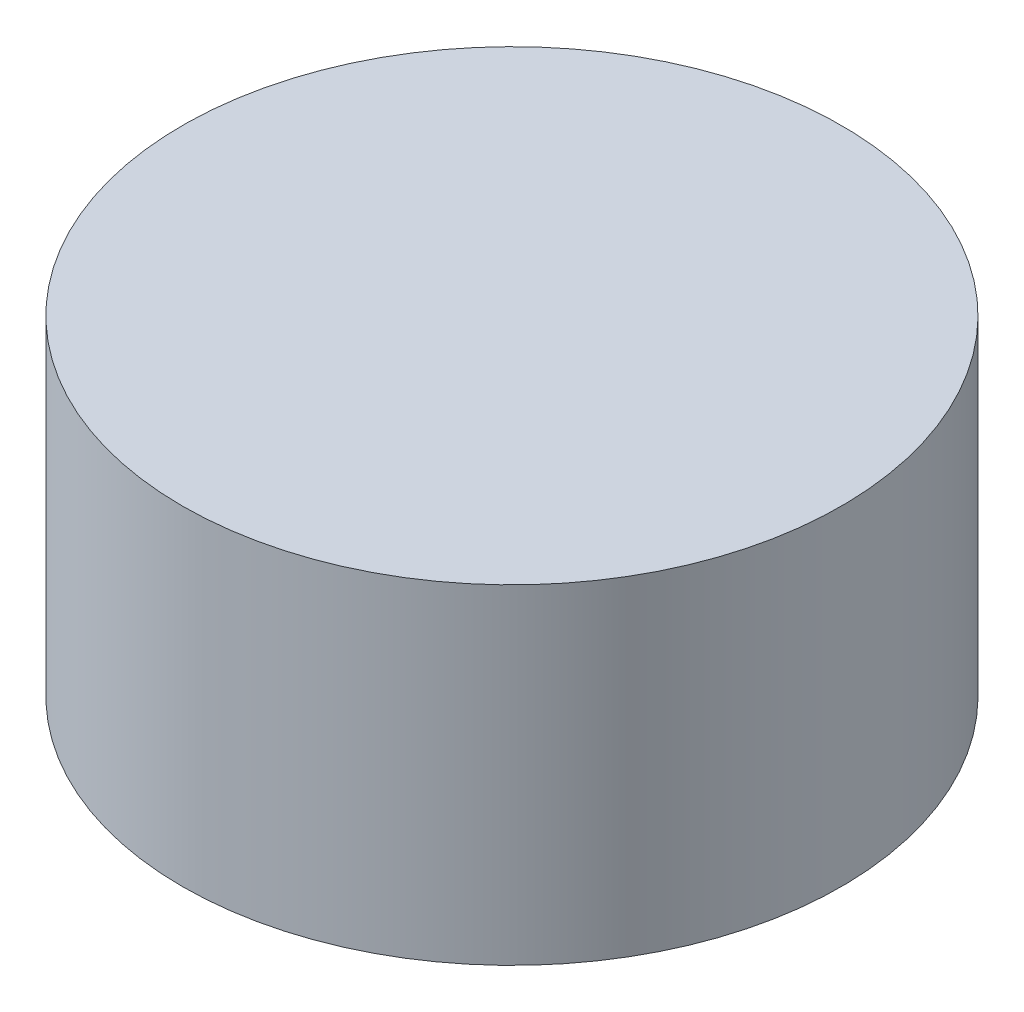
ISO-10303-21;
HEADER;
FILE_DESCRIPTION(('STEP AP214'),'2;1');
FILE_NAME('part.step','',(''),(''),'','','');
FILE_SCHEMA(('AUTOMOTIVE_DESIGN { 1 0 10303 214 1 1 1 1 }'));
ENDSEC;
DATA;
#1=APPLICATION_CONTEXT('core data for automotive mechanical design processes');
#2=APPLICATION_PROTOCOL_DEFINITION('international standard','automotive_design',2000,#1);
#3=PRODUCT_CONTEXT('',#1,'mechanical');
#4=PRODUCT('Part','Part','',(#3));
#5=PRODUCT_RELATED_PRODUCT_CATEGORY('part','',(#4));
#6=PRODUCT_DEFINITION_FORMATION('','',#4);
#7=PRODUCT_DEFINITION_CONTEXT('part definition',#1,'design');
#8=PRODUCT_DEFINITION('design','',#6,#7);
#9=PRODUCT_DEFINITION_SHAPE('','',#8);
#10=(LENGTH_UNIT() NAMED_UNIT(*) SI_UNIT(.MILLI.,.METRE.));
#11=(NAMED_UNIT(*) PLANE_ANGLE_UNIT() SI_UNIT($,.RADIAN.));
#12=(NAMED_UNIT(*) SI_UNIT($,.STERADIAN.) SOLID_ANGLE_UNIT());
#13=UNCERTAINTY_MEASURE_WITH_UNIT(LENGTH_MEASURE(1.E-05),#10,'distance_accuracy_value','');
#14=(GEOMETRIC_REPRESENTATION_CONTEXT(3) GLOBAL_UNCERTAINTY_ASSIGNED_CONTEXT((#13)) GLOBAL_UNIT_ASSIGNED_CONTEXT((#10,
#11,#12)) REPRESENTATION_CONTEXT('',''));
#15=CARTESIAN_POINT('',(0.,0.,0.));
#16=DIRECTION('',(0.,0.,1.));
#17=DIRECTION('',(1.,0.,0.));
#18=AXIS2_PLACEMENT_3D('',#15,#16,#17);
#19=CARTESIAN_POINT('',(0.,2.,0.));
#20=DIRECTION('',(0.,-1.,0.));
#21=DIRECTION('',(0.,0.,-1.));
#22=AXIS2_PLACEMENT_3D('',#19,#20,#21);
#23=CYLINDRICAL_SURFACE('',#22,2.);
#24=CARTESIAN_POINT('',(0.,2.,0.));
#25=DIRECTION('',(0.,1.,0.));
#26=DIRECTION('',(0.,0.,1.));
#27=AXIS2_PLACEMENT_3D('',#24,#25,#26);
#28=CIRCLE('',#27,2.);
#29=CARTESIAN_POINT('',(0.,2.,2.));
#30=VERTEX_POINT('',#29);
#31=EDGE_CURVE('E10',#30,#30,#28,.T.);
#32=ORIENTED_EDGE('',*,*,#31,.F.);
#33=EDGE_LOOP('',(#32));
#34=FACE_BOUND('',#33,.T.);
#35=CARTESIAN_POINT('',(0.,0.,0.));
#36=DIRECTION('',(0.,1.,0.));
#37=DIRECTION('',(0.,0.,1.));
#38=AXIS2_PLACEMENT_3D('',#35,#36,#37);
#39=CIRCLE('',#38,2.);
#40=CARTESIAN_POINT('',(0.,0.,2.));
#41=VERTEX_POINT('',#40);
#42=EDGE_CURVE('E37',#41,#41,#39,.T.);
#43=ORIENTED_EDGE('',*,*,#42,.T.);
#44=EDGE_LOOP('',(#43));
#45=FACE_BOUND('',#44,.T.);
#46=ADVANCED_FACE('F34',(#34,#45),#23,.T.);
#47=CARTESIAN_POINT('',(0.,2.,0.));
#48=DIRECTION('',(0.,1.,0.));
#49=DIRECTION('',(0.,0.,1.));
#50=AXIS2_PLACEMENT_3D('',#47,#48,#49);
#51=PLANE('',#50);
#52=ORIENTED_EDGE('',*,*,#31,.T.);
#53=EDGE_LOOP('',(#52));
#54=FACE_BOUND('',#53,.T.);
#55=ADVANCED_FACE('F49',(#54),#51,.T.);
#56=CARTESIAN_POINT('',(0.,0.,0.));
#57=DIRECTION('',(0.,1.,0.));
#58=DIRECTION('',(0.,0.,1.));
#59=AXIS2_PLACEMENT_3D('',#56,#57,#58);
#60=PLANE('',#59);
#61=ORIENTED_EDGE('',*,*,#42,.F.);
#62=EDGE_LOOP('',(#61));
#63=FACE_BOUND('',#62,.T.);
#64=ADVANCED_FACE('F47',(#63),#60,.F.);
#65=CLOSED_SHELL('',(#46,#55,#64));
#66=MANIFOLD_SOLID_BREP('B2',#65);
#67=ADVANCED_BREP_SHAPE_REPRESENTATION('',(#18,#66),#14);
#68=SHAPE_DEFINITION_REPRESENTATION(#9,#67);
ENDSEC;
END-ISO-10303-21;
